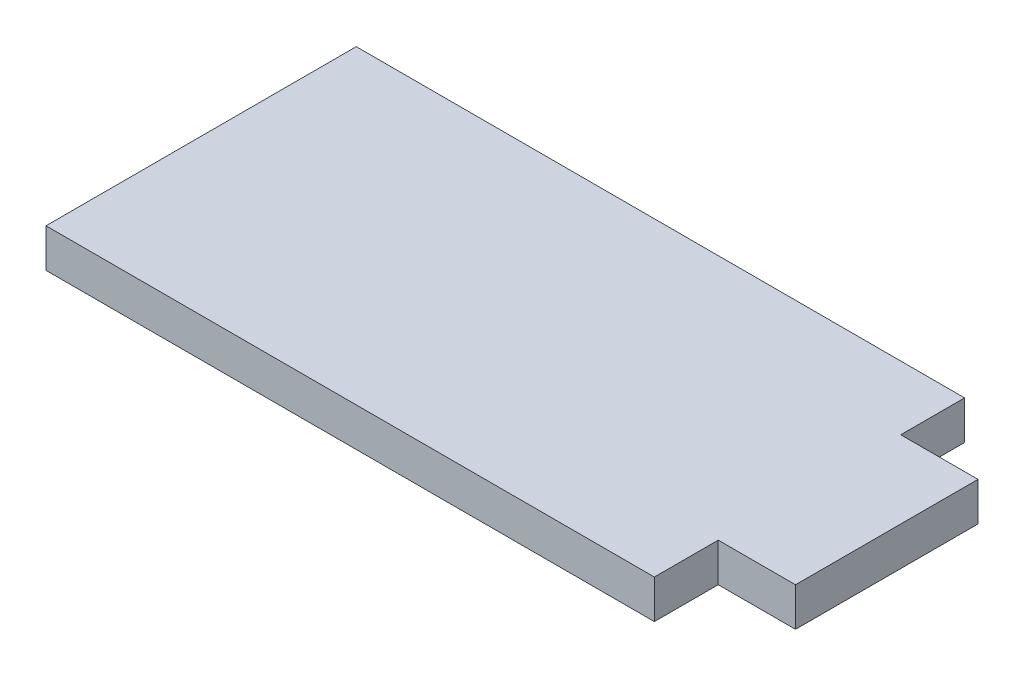
ISO-10303-21;
HEADER;
FILE_DESCRIPTION(('STEP AP214'),'2;1');
FILE_NAME('part.step','',(''),(''),'','','');
FILE_SCHEMA(('AUTOMOTIVE_DESIGN { 1 0 10303 214 1 1 1 1 }'));
ENDSEC;
DATA;
#1=APPLICATION_CONTEXT('core data for automotive mechanical design processes');
#2=APPLICATION_PROTOCOL_DEFINITION('international standard','automotive_design',2000,#1);
#3=PRODUCT_CONTEXT('',#1,'mechanical');
#4=PRODUCT('Part','Part','',(#3));
#5=PRODUCT_RELATED_PRODUCT_CATEGORY('part','',(#4));
#6=PRODUCT_DEFINITION_FORMATION('','',#4);
#7=PRODUCT_DEFINITION_CONTEXT('part definition',#1,'design');
#8=PRODUCT_DEFINITION('design','',#6,#7);
#9=PRODUCT_DEFINITION_SHAPE('','',#8);
#10=(LENGTH_UNIT() NAMED_UNIT(*) SI_UNIT(.MILLI.,.METRE.));
#11=(NAMED_UNIT(*) PLANE_ANGLE_UNIT() SI_UNIT($,.RADIAN.));
#12=(NAMED_UNIT(*) SI_UNIT($,.STERADIAN.) SOLID_ANGLE_UNIT());
#13=UNCERTAINTY_MEASURE_WITH_UNIT(LENGTH_MEASURE(1.E-05),#10,'distance_accuracy_value','');
#14=(GEOMETRIC_REPRESENTATION_CONTEXT(3) GLOBAL_UNCERTAINTY_ASSIGNED_CONTEXT((#13)) GLOBAL_UNIT_ASSIGNED_CONTEXT((#10,
#11,#12)) REPRESENTATION_CONTEXT('',''));
#15=CARTESIAN_POINT('',(0.,0.,0.));
#16=DIRECTION('',(0.,0.,1.));
#17=DIRECTION('',(1.,0.,0.));
#18=AXIS2_PLACEMENT_3D('',#15,#16,#17);
#19=CARTESIAN_POINT('',(-25.,3.175,0.));
#20=DIRECTION('',(-1.,0.,0.));
#21=DIRECTION('',(0.,0.,1.));
#22=AXIS2_PLACEMENT_3D('',#19,#20,#21);
#23=PLANE('',#22);
#24=DIRECTION('',(0.,0.,-1.));
#25=VECTOR('',#24,1.);
#26=CARTESIAN_POINT('',(-25.,0.,0.));
#27=LINE('',#26,#25);
#28=CARTESIAN_POINT('',(-25.,0.,20.25));
#29=VERTEX_POINT('',#28);
#30=CARTESIAN_POINT('',(-25.,0.,-5.25));
#31=VERTEX_POINT('',#30);
#32=EDGE_CURVE('E128',#29,#31,#27,.T.);
#33=ORIENTED_EDGE('',*,*,#32,.F.);
#34=DIRECTION('',(0.,-1.,0.));
#35=VECTOR('',#34,1.);
#36=CARTESIAN_POINT('',(-25.,3.175,20.25));
#37=LINE('',#36,#35);
#38=CARTESIAN_POINT('',(-25.,3.175,20.25));
#39=VERTEX_POINT('',#38);
#40=EDGE_CURVE('E11',#39,#29,#37,.T.);
#41=ORIENTED_EDGE('',*,*,#40,.F.);
#42=DIRECTION('',(0.,0.,-1.));
#43=VECTOR('',#42,1.);
#44=CARTESIAN_POINT('',(-25.,3.175,0.));
#45=LINE('',#44,#43);
#46=CARTESIAN_POINT('',(-25.,3.175,-5.25));
#47=VERTEX_POINT('',#46);
#48=EDGE_CURVE('E148',#39,#47,#45,.T.);
#49=ORIENTED_EDGE('',*,*,#48,.T.);
#50=DIRECTION('',(0.,-1.,0.));
#51=VECTOR('',#50,1.);
#52=CARTESIAN_POINT('',(-25.,3.175,-5.25));
#53=LINE('',#52,#51);
#54=EDGE_CURVE('E51',#47,#31,#53,.T.);
#55=ORIENTED_EDGE('',*,*,#54,.T.);
#56=EDGE_LOOP('',(#33,#41,#49,#55));
#57=FACE_BOUND('',#56,.T.);
#58=ADVANCED_FACE('F35',(#57),#23,.T.);
#59=CARTESIAN_POINT('',(0.,3.175,20.25));
#60=DIRECTION('',(0.,0.,1.));
#61=DIRECTION('',(1.,0.,0.));
#62=AXIS2_PLACEMENT_3D('',#59,#60,#61);
#63=PLANE('',#62);
#64=DIRECTION('',(-1.,0.,0.));
#65=VECTOR('',#64,1.);
#66=CARTESIAN_POINT('',(0.,0.,20.25));
#67=LINE('',#66,#65);
#68=CARTESIAN_POINT('',(25.,0.,20.25));
#69=VERTEX_POINT('',#68);
#70=EDGE_CURVE('E130',#69,#29,#67,.T.);
#71=ORIENTED_EDGE('',*,*,#70,.F.);
#72=DIRECTION('',(0.,-1.,0.));
#73=VECTOR('',#72,1.);
#74=CARTESIAN_POINT('',(25.,3.175,20.25));
#75=LINE('',#74,#73);
#76=CARTESIAN_POINT('',(25.,3.175,20.25));
#77=VERTEX_POINT('',#76);
#78=EDGE_CURVE('E43',#77,#69,#75,.T.);
#79=ORIENTED_EDGE('',*,*,#78,.F.);
#80=DIRECTION('',(-1.,0.,0.));
#81=VECTOR('',#80,1.);
#82=CARTESIAN_POINT('',(0.,3.175,20.25));
#83=LINE('',#82,#81);
#84=EDGE_CURVE('E174',#77,#39,#83,.T.);
#85=ORIENTED_EDGE('',*,*,#84,.T.);
#86=ORIENTED_EDGE('',*,*,#40,.T.);
#87=EDGE_LOOP('',(#71,#79,#85,#86));
#88=FACE_BOUND('',#87,.T.);
#89=ADVANCED_FACE('F165',(#88),#63,.T.);
#90=CARTESIAN_POINT('',(25.,3.175,0.));
#91=DIRECTION('',(1.,0.,0.));
#92=DIRECTION('',(0.,0.,-1.));
#93=AXIS2_PLACEMENT_3D('',#90,#91,#92);
#94=PLANE('',#93);
#95=DIRECTION('',(0.,0.,1.));
#96=VECTOR('',#95,1.);
#97=CARTESIAN_POINT('',(25.,0.,0.));
#98=LINE('',#97,#96);
#99=CARTESIAN_POINT('',(25.,0.,15.));
#100=VERTEX_POINT('',#99);
#101=EDGE_CURVE('E133',#100,#69,#98,.T.);
#102=ORIENTED_EDGE('',*,*,#101,.F.);
#103=DIRECTION('',(0.,-1.,0.));
#104=VECTOR('',#103,1.);
#105=CARTESIAN_POINT('',(25.,3.175,15.));
#106=LINE('',#105,#104);
#107=CARTESIAN_POINT('',(25.,3.175,15.));
#108=VERTEX_POINT('',#107);
#109=EDGE_CURVE('E154',#108,#100,#106,.T.);
#110=ORIENTED_EDGE('',*,*,#109,.F.);
#111=DIRECTION('',(0.,0.,1.));
#112=VECTOR('',#111,1.);
#113=CARTESIAN_POINT('',(25.,3.175,0.));
#114=LINE('',#113,#112);
#115=EDGE_CURVE('E161',#108,#77,#114,.T.);
#116=ORIENTED_EDGE('',*,*,#115,.T.);
#117=ORIENTED_EDGE('',*,*,#78,.T.);
#118=EDGE_LOOP('',(#102,#110,#116,#117));
#119=FACE_BOUND('',#118,.T.);
#120=ADVANCED_FACE('F159',(#119),#94,.T.);
#121=CARTESIAN_POINT('',(0.,3.175,15.));
#122=DIRECTION('',(0.,0.,1.));
#123=DIRECTION('',(1.,0.,0.));
#124=AXIS2_PLACEMENT_3D('',#121,#122,#123);
#125=PLANE('',#124);
#126=DIRECTION('',(-1.,0.,0.));
#127=VECTOR('',#126,1.);
#128=CARTESIAN_POINT('',(0.,0.,15.));
#129=LINE('',#128,#127);
#130=CARTESIAN_POINT('',(31.35,0.,15.));
#131=VERTEX_POINT('',#130);
#132=EDGE_CURVE('E136',#131,#100,#129,.T.);
#133=ORIENTED_EDGE('',*,*,#132,.F.);
#134=DIRECTION('',(0.,-1.,0.));
#135=VECTOR('',#134,1.);
#136=CARTESIAN_POINT('',(31.35,3.175,15.));
#137=LINE('',#136,#135);
#138=CARTESIAN_POINT('',(31.35,3.175,15.));
#139=VERTEX_POINT('',#138);
#140=EDGE_CURVE('E152',#139,#131,#137,.T.);
#141=ORIENTED_EDGE('',*,*,#140,.F.);
#142=DIRECTION('',(-1.,0.,0.));
#143=VECTOR('',#142,1.);
#144=CARTESIAN_POINT('',(0.,3.175,15.));
#145=LINE('',#144,#143);
#146=EDGE_CURVE('E173',#139,#108,#145,.T.);
#147=ORIENTED_EDGE('',*,*,#146,.T.);
#148=ORIENTED_EDGE('',*,*,#109,.T.);
#149=EDGE_LOOP('',(#133,#141,#147,#148));
#150=FACE_BOUND('',#149,.T.);
#151=ADVANCED_FACE('F171',(#150),#125,.T.);
#152=CARTESIAN_POINT('',(31.35,3.175,0.));
#153=DIRECTION('',(1.,0.,0.));
#154=DIRECTION('',(0.,0.,-1.));
#155=AXIS2_PLACEMENT_3D('',#152,#153,#154);
#156=PLANE('',#155);
#157=DIRECTION('',(0.,0.,1.));
#158=VECTOR('',#157,1.);
#159=CARTESIAN_POINT('',(31.35,0.,0.));
#160=LINE('',#159,#158);
#161=CARTESIAN_POINT('',(31.35,0.,0.));
#162=VERTEX_POINT('',#161);
#163=EDGE_CURVE('E139',#162,#131,#160,.T.);
#164=ORIENTED_EDGE('',*,*,#163,.F.);
#165=DIRECTION('',(0.,-1.,0.));
#166=VECTOR('',#165,1.);
#167=CARTESIAN_POINT('',(31.35,3.175,0.));
#168=LINE('',#167,#166);
#169=CARTESIAN_POINT('',(31.35,3.175,0.));
#170=VERTEX_POINT('',#169);
#171=EDGE_CURVE('E110',#170,#162,#168,.T.);
#172=ORIENTED_EDGE('',*,*,#171,.F.);
#173=DIRECTION('',(0.,0.,1.));
#174=VECTOR('',#173,1.);
#175=CARTESIAN_POINT('',(31.35,3.175,0.));
#176=LINE('',#175,#174);
#177=EDGE_CURVE('E120',#170,#139,#176,.T.);
#178=ORIENTED_EDGE('',*,*,#177,.T.);
#179=ORIENTED_EDGE('',*,*,#140,.T.);
#180=EDGE_LOOP('',(#164,#172,#178,#179));
#181=FACE_BOUND('',#180,.T.);
#182=ADVANCED_FACE('F180',(#181),#156,.T.);
#183=CARTESIAN_POINT('',(0.,3.175,0.));
#184=DIRECTION('',(0.,0.,-1.));
#185=DIRECTION('',(-1.,0.,0.));
#186=AXIS2_PLACEMENT_3D('',#183,#184,#185);
#187=PLANE('',#186);
#188=DIRECTION('',(1.,0.,0.));
#189=VECTOR('',#188,1.);
#190=CARTESIAN_POINT('',(0.,0.,0.));
#191=LINE('',#190,#189);
#192=CARTESIAN_POINT('',(25.,0.,0.));
#193=VERTEX_POINT('',#192);
#194=EDGE_CURVE('E106',#193,#162,#191,.T.);
#195=ORIENTED_EDGE('',*,*,#194,.F.);
#196=DIRECTION('',(0.,-1.,0.));
#197=VECTOR('',#196,1.);
#198=CARTESIAN_POINT('',(25.,3.175,0.));
#199=LINE('',#198,#197);
#200=CARTESIAN_POINT('',(25.,3.175,0.));
#201=VERTEX_POINT('',#200);
#202=EDGE_CURVE('E101',#201,#193,#199,.T.);
#203=ORIENTED_EDGE('',*,*,#202,.F.);
#204=DIRECTION('',(1.,0.,0.));
#205=VECTOR('',#204,1.);
#206=CARTESIAN_POINT('',(0.,3.175,0.));
#207=LINE('',#206,#205);
#208=EDGE_CURVE('E104',#201,#170,#207,.T.);
#209=ORIENTED_EDGE('',*,*,#208,.T.);
#210=ORIENTED_EDGE('',*,*,#171,.T.);
#211=EDGE_LOOP('',(#195,#203,#209,#210));
#212=FACE_BOUND('',#211,.T.);
#213=ADVANCED_FACE('F103',(#212),#187,.T.);
#214=CARTESIAN_POINT('',(25.,3.175,0.));
#215=DIRECTION('',(1.,0.,0.));
#216=DIRECTION('',(0.,0.,-1.));
#217=AXIS2_PLACEMENT_3D('',#214,#215,#216);
#218=PLANE('',#217);
#219=DIRECTION('',(0.,0.,1.));
#220=VECTOR('',#219,1.);
#221=CARTESIAN_POINT('',(25.,0.,0.));
#222=LINE('',#221,#220);
#223=CARTESIAN_POINT('',(25.,0.,-5.25));
#224=VERTEX_POINT('',#223);
#225=EDGE_CURVE('E143',#224,#193,#222,.T.);
#226=ORIENTED_EDGE('',*,*,#225,.F.);
#227=DIRECTION('',(0.,-1.,0.));
#228=VECTOR('',#227,1.);
#229=CARTESIAN_POINT('',(25.,3.175,-5.25));
#230=LINE('',#229,#228);
#231=CARTESIAN_POINT('',(25.,3.175,-5.25));
#232=VERTEX_POINT('',#231);
#233=EDGE_CURVE('E76',#232,#224,#230,.T.);
#234=ORIENTED_EDGE('',*,*,#233,.F.);
#235=DIRECTION('',(0.,0.,1.));
#236=VECTOR('',#235,1.);
#237=CARTESIAN_POINT('',(25.,3.175,0.));
#238=LINE('',#237,#236);
#239=EDGE_CURVE('E117',#232,#201,#238,.T.);
#240=ORIENTED_EDGE('',*,*,#239,.T.);
#241=ORIENTED_EDGE('',*,*,#202,.T.);
#242=EDGE_LOOP('',(#226,#234,#240,#241));
#243=FACE_BOUND('',#242,.T.);
#244=ADVANCED_FACE('F122',(#243),#218,.T.);
#245=CARTESIAN_POINT('',(0.,3.175,-5.25));
#246=DIRECTION('',(0.,0.,-1.));
#247=DIRECTION('',(-1.,0.,0.));
#248=AXIS2_PLACEMENT_3D('',#245,#246,#247);
#249=PLANE('',#248);
#250=DIRECTION('',(1.,0.,0.));
#251=VECTOR('',#250,1.);
#252=CARTESIAN_POINT('',(0.,0.,-5.25));
#253=LINE('',#252,#251);
#254=EDGE_CURVE('E145',#31,#224,#253,.T.);
#255=ORIENTED_EDGE('',*,*,#254,.F.);
#256=ORIENTED_EDGE('',*,*,#54,.F.);
#257=DIRECTION('',(1.,0.,0.));
#258=VECTOR('',#257,1.);
#259=CARTESIAN_POINT('',(0.,3.175,-5.25));
#260=LINE('',#259,#258);
#261=EDGE_CURVE('E123',#47,#232,#260,.T.);
#262=ORIENTED_EDGE('',*,*,#261,.T.);
#263=ORIENTED_EDGE('',*,*,#233,.T.);
#264=EDGE_LOOP('',(#255,#256,#262,#263));
#265=FACE_BOUND('',#264,.T.);
#266=ADVANCED_FACE('F181',(#265),#249,.T.);
#267=CARTESIAN_POINT('',(0.,3.175,0.));
#268=DIRECTION('',(0.,1.,0.));
#269=DIRECTION('',(0.,0.,1.));
#270=AXIS2_PLACEMENT_3D('',#267,#268,#269);
#271=PLANE('',#270);
#272=ORIENTED_EDGE('',*,*,#48,.F.);
#273=ORIENTED_EDGE('',*,*,#84,.F.);
#274=ORIENTED_EDGE('',*,*,#115,.F.);
#275=ORIENTED_EDGE('',*,*,#146,.F.);
#276=ORIENTED_EDGE('',*,*,#177,.F.);
#277=ORIENTED_EDGE('',*,*,#208,.F.);
#278=ORIENTED_EDGE('',*,*,#239,.F.);
#279=ORIENTED_EDGE('',*,*,#261,.F.);
#280=EDGE_LOOP('',(#272,#273,#274,#275,#276,#277,#278,#279));
#281=FACE_BOUND('',#280,.T.);
#282=ADVANCED_FACE('F115',(#281),#271,.T.);
#283=CARTESIAN_POINT('',(0.,0.,0.));
#284=DIRECTION('',(0.,1.,0.));
#285=DIRECTION('',(0.,0.,1.));
#286=AXIS2_PLACEMENT_3D('',#283,#284,#285);
#287=PLANE('',#286);
#288=ORIENTED_EDGE('',*,*,#32,.T.);
#289=ORIENTED_EDGE('',*,*,#254,.T.);
#290=ORIENTED_EDGE('',*,*,#225,.T.);
#291=ORIENTED_EDGE('',*,*,#194,.T.);
#292=ORIENTED_EDGE('',*,*,#163,.T.);
#293=ORIENTED_EDGE('',*,*,#132,.T.);
#294=ORIENTED_EDGE('',*,*,#101,.T.);
#295=ORIENTED_EDGE('',*,*,#70,.T.);
#296=EDGE_LOOP('',(#288,#289,#290,#291,#292,#293,#294,#295));
#297=FACE_BOUND('',#296,.T.);
#298=ADVANCED_FACE('F167',(#297),#287,.F.);
#299=CLOSED_SHELL('',(#58,#89,#120,#151,#182,#213,#244,#266,#282,#298));
#300=MANIFOLD_SOLID_BREP('B2',#299);
#301=ADVANCED_BREP_SHAPE_REPRESENTATION('',(#18,#300),#14);
#302=SHAPE_DEFINITION_REPRESENTATION(#9,#301);
ENDSEC;
END-ISO-10303-21;
